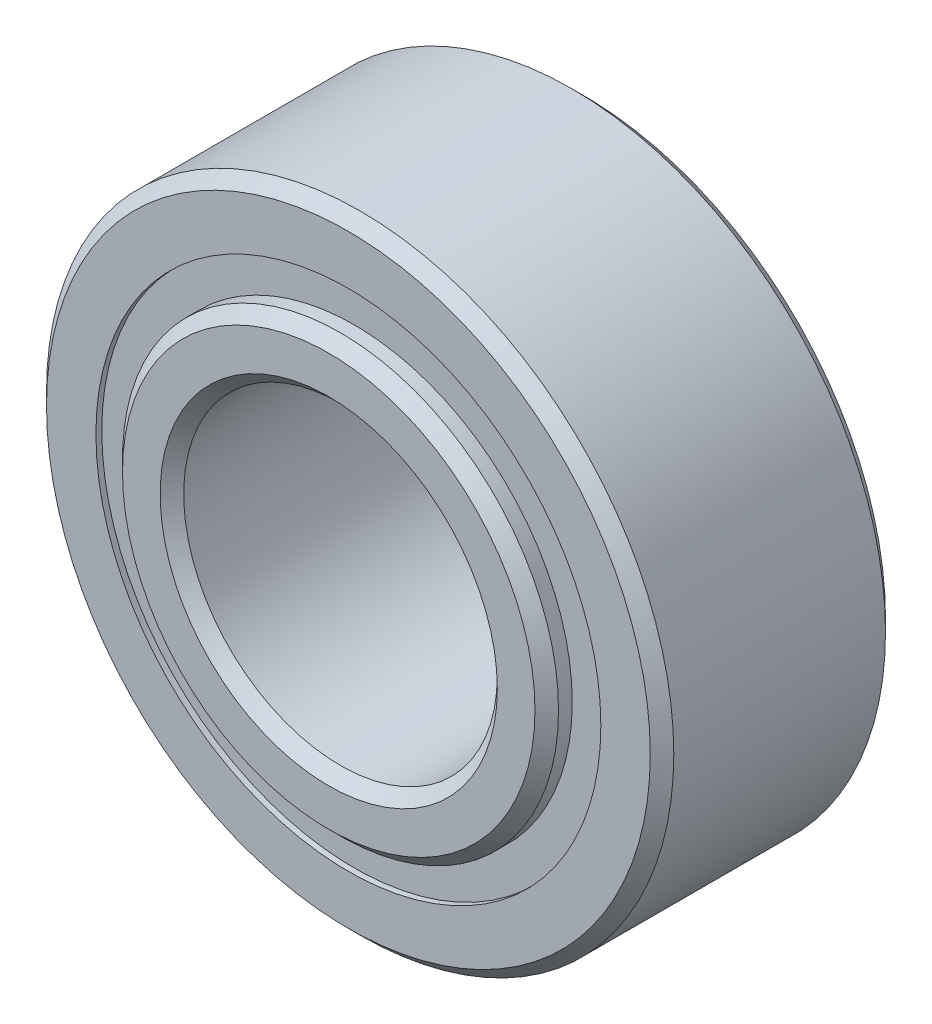
ISO-10303-21;
HEADER;
FILE_DESCRIPTION(('STEP AP214'),'2;1');
FILE_NAME('part.step','',(''),(''),'','','');
FILE_SCHEMA(('AUTOMOTIVE_DESIGN { 1 0 10303 214 1 1 1 1 }'));
ENDSEC;
DATA;
#1=APPLICATION_CONTEXT('core data for automotive mechanical design processes');
#2=APPLICATION_PROTOCOL_DEFINITION('international standard','automotive_design',2000,#1);
#3=PRODUCT_CONTEXT('',#1,'mechanical');
#4=PRODUCT('Part','Part','',(#3));
#5=PRODUCT_RELATED_PRODUCT_CATEGORY('part','',(#4));
#6=PRODUCT_DEFINITION_FORMATION('','',#4);
#7=PRODUCT_DEFINITION_CONTEXT('part definition',#1,'design');
#8=PRODUCT_DEFINITION('design','',#6,#7);
#9=PRODUCT_DEFINITION_SHAPE('','',#8);
#10=(LENGTH_UNIT() NAMED_UNIT(*) SI_UNIT(.MILLI.,.METRE.));
#11=(NAMED_UNIT(*) PLANE_ANGLE_UNIT() SI_UNIT($,.RADIAN.));
#12=(NAMED_UNIT(*) SI_UNIT($,.STERADIAN.) SOLID_ANGLE_UNIT());
#13=UNCERTAINTY_MEASURE_WITH_UNIT(LENGTH_MEASURE(1.E-05),#10,'distance_accuracy_value','');
#14=(GEOMETRIC_REPRESENTATION_CONTEXT(3) GLOBAL_UNCERTAINTY_ASSIGNED_CONTEXT((#13)) GLOBAL_UNIT_ASSIGNED_CONTEXT((#10,
#11,#12)) REPRESENTATION_CONTEXT('',''));
#15=CARTESIAN_POINT('',(0.,0.,0.));
#16=DIRECTION('',(0.,0.,1.));
#17=DIRECTION('',(1.,0.,0.));
#18=AXIS2_PLACEMENT_3D('',#15,#16,#17);
#19=CARTESIAN_POINT('',(0.,5.1114010989011,-2.2621875));
#20=DIRECTION('',(0.,0.,1.));
#21=DIRECTION('',(1.,0.,0.));
#22=AXIS2_PLACEMENT_3D('',#19,#20,#21);
#23=PLANE('',#22);
#24=CARTESIAN_POINT('',(0.,0.,-2.2621875));
#25=DIRECTION('',(0.,0.,1.));
#26=DIRECTION('',(1.,0.,0.));
#27=AXIS2_PLACEMENT_3D('',#24,#25,#26);
#28=CIRCLE('',#27,5.1114010989011);
#29=CARTESIAN_POINT('',(5.1114010989011,0.,-2.2621875));
#30=VERTEX_POINT('',#29);
#31=EDGE_CURVE('E56',#30,#30,#28,.T.);
#32=ORIENTED_EDGE('',*,*,#31,.F.);
#33=EDGE_LOOP('',(#32));
#34=FACE_BOUND('',#33,.T.);
#35=CARTESIAN_POINT('',(0.,0.,-2.2621875));
#36=DIRECTION('',(0.,0.,1.));
#37=DIRECTION('',(1.,0.,0.));
#38=AXIS2_PLACEMENT_3D('',#35,#36,#37);
#39=CIRCLE('',#38,4.41359890109897);
#40=CARTESIAN_POINT('',(4.41359890109897,0.,-2.2621875));
#41=VERTEX_POINT('',#40);
#42=EDGE_CURVE('E11',#41,#41,#39,.T.);
#43=ORIENTED_EDGE('',*,*,#42,.T.);
#44=EDGE_LOOP('',(#43));
#45=FACE_BOUND('',#44,.T.);
#46=ADVANCED_FACE('F42',(#34,#45),#23,.F.);
#47=CARTESIAN_POINT('',(0.,0.,2.38125));
#48=DIRECTION('',(0.,0.,1.));
#49=DIRECTION('',(1.,0.,0.));
#50=AXIS2_PLACEMENT_3D('',#47,#48,#49);
#51=CYLINDRICAL_SURFACE('',#50,4.41359890109897);
#52=ORIENTED_EDGE('',*,*,#42,.F.);
#53=EDGE_LOOP('',(#52));
#54=FACE_BOUND('',#53,.T.);
#55=CARTESIAN_POINT('',(0.,0.,-1.11436144103197));
#56=DIRECTION('',(0.,0.,1.));
#57=DIRECTION('',(1.,0.,0.));
#58=AXIS2_PLACEMENT_3D('',#55,#56,#57);
#59=CIRCLE('',#58,4.41359890109897);
#60=CARTESIAN_POINT('',(4.41359890109897,0.,-1.11436144103197));
#61=VERTEX_POINT('',#60);
#62=EDGE_CURVE('E48',#61,#61,#59,.T.);
#63=ORIENTED_EDGE('',*,*,#62,.T.);
#64=EDGE_LOOP('',(#63));
#65=FACE_BOUND('',#64,.T.);
#66=ADVANCED_FACE('F65',(#54,#65),#51,.F.);
#67=CARTESIAN_POINT('',(0.,5.1114010989011,-1.11436144103197));
#68=DIRECTION('',(0.,0.,-1.));
#69=DIRECTION('',(-1.,0.,0.));
#70=AXIS2_PLACEMENT_3D('',#67,#68,#69);
#71=PLANE('',#70);
#72=ORIENTED_EDGE('',*,*,#62,.F.);
#73=EDGE_LOOP('',(#72));
#74=FACE_BOUND('',#73,.T.);
#75=CARTESIAN_POINT('',(0.,0.,-1.11436144103197));
#76=DIRECTION('',(0.,0.,1.));
#77=DIRECTION('',(1.,0.,0.));
#78=AXIS2_PLACEMENT_3D('',#75,#76,#77);
#79=CIRCLE('',#78,5.1114010989011);
#80=CARTESIAN_POINT('',(5.1114010989011,0.,-1.11436144103197));
#81=VERTEX_POINT('',#80);
#82=EDGE_CURVE('E52',#81,#81,#79,.T.);
#83=ORIENTED_EDGE('',*,*,#82,.T.);
#84=EDGE_LOOP('',(#83));
#85=FACE_BOUND('',#84,.T.);
#86=ADVANCED_FACE('F69',(#74,#85),#71,.F.);
#87=CARTESIAN_POINT('',(0.,0.,2.38125));
#88=DIRECTION('',(0.,0.,1.));
#89=DIRECTION('',(1.,0.,0.));
#90=AXIS2_PLACEMENT_3D('',#87,#88,#89);
#91=CYLINDRICAL_SURFACE('',#90,5.1114010989011);
#92=ORIENTED_EDGE('',*,*,#82,.F.);
#93=EDGE_LOOP('',(#92));
#94=FACE_BOUND('',#93,.T.);
#95=ORIENTED_EDGE('',*,*,#31,.T.);
#96=EDGE_LOOP('',(#95));
#97=FACE_BOUND('',#96,.T.);
#98=ADVANCED_FACE('F62',(#94,#97),#91,.T.);
#99=CLOSED_SHELL('',(#46,#66,#86,#98));
#100=MANIFOLD_SOLID_BREP('B2',#99);
#101=CARTESIAN_POINT('',(0.,5.1114010989011,2.2621875));
#102=DIRECTION('',(0.,0.,-1.));
#103=DIRECTION('',(-1.,0.,0.));
#104=AXIS2_PLACEMENT_3D('',#101,#102,#103);
#105=PLANE('',#104);
#106=CARTESIAN_POINT('',(0.,0.,2.2621875));
#107=DIRECTION('',(0.,0.,1.));
#108=DIRECTION('',(1.,0.,0.));
#109=AXIS2_PLACEMENT_3D('',#106,#107,#108);
#110=CIRCLE('',#109,4.41359890109897);
#111=CARTESIAN_POINT('',(4.41359890109897,0.,2.2621875));
#112=VERTEX_POINT('',#111);
#113=EDGE_CURVE('E41',#112,#112,#110,.T.);
#114=ORIENTED_EDGE('',*,*,#113,.F.);
#115=EDGE_LOOP('',(#114));
#116=FACE_BOUND('',#115,.T.);
#117=CARTESIAN_POINT('',(0.,0.,2.2621875));
#118=DIRECTION('',(0.,0.,1.));
#119=DIRECTION('',(1.,0.,0.));
#120=AXIS2_PLACEMENT_3D('',#117,#118,#119);
#121=CIRCLE('',#120,5.1114010989011);
#122=CARTESIAN_POINT('',(5.1114010989011,0.,2.2621875));
#123=VERTEX_POINT('',#122);
#124=EDGE_CURVE('E124',#123,#123,#121,.T.);
#125=ORIENTED_EDGE('',*,*,#124,.T.);
#126=EDGE_LOOP('',(#125));
#127=FACE_BOUND('',#126,.T.);
#128=ADVANCED_FACE('F110',(#116,#127),#105,.F.);
#129=CARTESIAN_POINT('',(0.,0.,2.38125));
#130=DIRECTION('',(0.,0.,1.));
#131=DIRECTION('',(1.,0.,0.));
#132=AXIS2_PLACEMENT_3D('',#129,#130,#131);
#133=CYLINDRICAL_SURFACE('',#132,4.41359890109897);
#134=CARTESIAN_POINT('',(0.,0.,1.11436144103197));
#135=DIRECTION('',(0.,0.,1.));
#136=DIRECTION('',(1.,0.,0.));
#137=AXIS2_PLACEMENT_3D('',#134,#135,#136);
#138=CIRCLE('',#137,4.41359890109897);
#139=CARTESIAN_POINT('',(4.41359890109897,0.,1.11436144103197));
#140=VERTEX_POINT('',#139);
#141=EDGE_CURVE('E116',#140,#140,#138,.T.);
#142=ORIENTED_EDGE('',*,*,#141,.F.);
#143=EDGE_LOOP('',(#142));
#144=FACE_BOUND('',#143,.T.);
#145=ORIENTED_EDGE('',*,*,#113,.T.);
#146=EDGE_LOOP('',(#145));
#147=FACE_BOUND('',#146,.T.);
#148=ADVANCED_FACE('F139',(#144,#147),#133,.F.);
#149=CARTESIAN_POINT('',(0.,5.1114010989011,1.11436144103197));
#150=DIRECTION('',(0.,0.,1.));
#151=DIRECTION('',(1.,0.,0.));
#152=AXIS2_PLACEMENT_3D('',#149,#150,#151);
#153=PLANE('',#152);
#154=CARTESIAN_POINT('',(0.,0.,1.11436144103197));
#155=DIRECTION('',(0.,0.,1.));
#156=DIRECTION('',(1.,0.,0.));
#157=AXIS2_PLACEMENT_3D('',#154,#155,#156);
#158=CIRCLE('',#157,5.1114010989011);
#159=CARTESIAN_POINT('',(5.1114010989011,0.,1.11436144103197));
#160=VERTEX_POINT('',#159);
#161=EDGE_CURVE('E120',#160,#160,#158,.T.);
#162=ORIENTED_EDGE('',*,*,#161,.F.);
#163=EDGE_LOOP('',(#162));
#164=FACE_BOUND('',#163,.T.);
#165=ORIENTED_EDGE('',*,*,#141,.T.);
#166=EDGE_LOOP('',(#165));
#167=FACE_BOUND('',#166,.T.);
#168=ADVANCED_FACE('F134',(#164,#167),#153,.F.);
#169=CARTESIAN_POINT('',(0.,0.,2.38125));
#170=DIRECTION('',(0.,0.,1.));
#171=DIRECTION('',(1.,0.,0.));
#172=AXIS2_PLACEMENT_3D('',#169,#170,#171);
#173=CYLINDRICAL_SURFACE('',#172,5.1114010989011);
#174=ORIENTED_EDGE('',*,*,#124,.F.);
#175=EDGE_LOOP('',(#174));
#176=FACE_BOUND('',#175,.T.);
#177=ORIENTED_EDGE('',*,*,#161,.T.);
#178=EDGE_LOOP('',(#177));
#179=FACE_BOUND('',#178,.T.);
#180=ADVANCED_FACE('F131',(#176,#179),#173,.T.);
#181=CLOSED_SHELL('',(#128,#148,#168,#180));
#182=MANIFOLD_SOLID_BREP('B6',#181);
#183=CARTESIAN_POINT('',(-2.79932726404285,3.85294343571072,0.));
#184=DIRECTION('',(0.,0.,1.));
#185=DIRECTION('',(-0.587785252292462,0.809016994374955,0.));
#186=AXIS2_PLACEMENT_3D('',#183,#184,#185);
#187=SPHERICAL_SURFACE('',#186,1.11436144103197);
#188=CARTESIAN_POINT('',(-2.79932726404285,3.85294343571072,1.11436144103197));
#189=VERTEX_POINT('',#188);
#190=VERTEX_LOOP('',#189);
#191=FACE_BOUND('',#190,.T.);
#192=ADVANCED_FACE('F177',(#191),#187,.T.);
#193=CLOSED_SHELL('',(#192));
#194=MANIFOLD_SOLID_BREP('B36',#193);
#195=CARTESIAN_POINT('',(-4.52940665885565,1.47169343571074,0.));
#196=DIRECTION('',(0.,0.,1.));
#197=DIRECTION('',(-0.95105651629515,0.309016994374958,0.));
#198=AXIS2_PLACEMENT_3D('',#195,#196,#197);
#199=SPHERICAL_SURFACE('',#198,1.11436144103197);
#200=CARTESIAN_POINT('',(-4.52940665885565,1.47169343571074,1.11436144103197));
#201=VERTEX_POINT('',#200);
#202=VERTEX_LOOP('',#201);
#203=FACE_BOUND('',#202,.T.);
#204=ADVANCED_FACE('F197',(#203),#199,.T.);
#205=CLOSED_SHELL('',(#204));
#206=MANIFOLD_SOLID_BREP('B106',#205);
#207=CARTESIAN_POINT('',(-4.52940665885568,-1.47169343571064,0.));
#208=DIRECTION('',(0.,0.,1.));
#209=DIRECTION('',(-0.951056516295157,-0.309016994374938,0.));
#210=AXIS2_PLACEMENT_3D('',#207,#208,#209);
#211=SPHERICAL_SURFACE('',#210,1.11436144103197);
#212=CARTESIAN_POINT('',(-4.52940665885568,-1.47169343571064,1.11436144103197));
#213=VERTEX_POINT('',#212);
#214=VERTEX_LOOP('',#213);
#215=FACE_BOUND('',#214,.T.);
#216=ADVANCED_FACE('F217',(#215),#211,.T.);
#217=CLOSED_SHELL('',(#216));
#218=MANIFOLD_SOLID_BREP('B173',#217);
#219=CARTESIAN_POINT('',(-2.79932726404294,-3.85294343571066,0.));
#220=DIRECTION('',(0.,0.,1.));
#221=DIRECTION('',(-0.58778525229248,-0.809016994374942,0.));
#222=AXIS2_PLACEMENT_3D('',#219,#220,#221);
#223=SPHERICAL_SURFACE('',#222,1.11436144103197);
#224=CARTESIAN_POINT('',(-2.79932726404294,-3.85294343571066,1.11436144103197));
#225=VERTEX_POINT('',#224);
#226=VERTEX_LOOP('',#225);
#227=FACE_BOUND('',#226,.T.);
#228=ADVANCED_FACE('F237',(#227),#223,.T.);
#229=CLOSED_SHELL('',(#228));
#230=MANIFOLD_SOLID_BREP('B193',#229);
#231=CARTESIAN_POINT('',(0.,-4.7625,0.));
#232=DIRECTION('',(0.,0.,1.));
#233=DIRECTION('',(0.,-1.,0.));
#234=AXIS2_PLACEMENT_3D('',#231,#232,#233);
#235=SPHERICAL_SURFACE('',#234,1.11436144103197);
#236=CARTESIAN_POINT('',(0.,-4.7625,1.11436144103197));
#237=VERTEX_POINT('',#236);
#238=VERTEX_LOOP('',#237);
#239=FACE_BOUND('',#238,.T.);
#240=ADVANCED_FACE('F257',(#239),#235,.T.);
#241=CLOSED_SHELL('',(#240));
#242=MANIFOLD_SOLID_BREP('B213',#241);
#243=CARTESIAN_POINT('',(2.79932726404288,-3.8529434357107,0.));
#244=DIRECTION('',(0.,0.,1.));
#245=DIRECTION('',(0.587785252292469,-0.809016994374951,0.));
#246=AXIS2_PLACEMENT_3D('',#243,#244,#245);
#247=SPHERICAL_SURFACE('',#246,1.11436144103197);
#248=CARTESIAN_POINT('',(2.79932726404288,-3.8529434357107,1.11436144103197));
#249=VERTEX_POINT('',#248);
#250=VERTEX_LOOP('',#249);
#251=FACE_BOUND('',#250,.T.);
#252=ADVANCED_FACE('F277',(#251),#247,.T.);
#253=CLOSED_SHELL('',(#252));
#254=MANIFOLD_SOLID_BREP('B233',#253);
#255=CARTESIAN_POINT('',(4.52940665885566,-1.47169343571071,0.));
#256=DIRECTION('',(0.,0.,1.));
#257=DIRECTION('',(0.951056516295152,-0.309016994374952,0.));
#258=AXIS2_PLACEMENT_3D('',#255,#256,#257);
#259=SPHERICAL_SURFACE('',#258,1.11436144103197);
#260=CARTESIAN_POINT('',(4.52940665885566,-1.47169343571071,1.11436144103197));
#261=VERTEX_POINT('',#260);
#262=VERTEX_LOOP('',#261);
#263=FACE_BOUND('',#262,.T.);
#264=ADVANCED_FACE('F297',(#263),#259,.T.);
#265=CLOSED_SHELL('',(#264));
#266=MANIFOLD_SOLID_BREP('B253',#265);
#267=CARTESIAN_POINT('',(4.52940665885567,1.47169343571067,0.));
#268=DIRECTION('',(0.,0.,1.));
#269=DIRECTION('',(0.951056516295155,0.309016994374945,0.));
#270=AXIS2_PLACEMENT_3D('',#267,#268,#269);
#271=SPHERICAL_SURFACE('',#270,1.11436144103197);
#272=CARTESIAN_POINT('',(4.52940665885567,1.47169343571067,1.11436144103197));
#273=VERTEX_POINT('',#272);
#274=VERTEX_LOOP('',#273);
#275=FACE_BOUND('',#274,.T.);
#276=ADVANCED_FACE('F317',(#275),#271,.T.);
#277=CLOSED_SHELL('',(#276));
#278=MANIFOLD_SOLID_BREP('B273',#277);
#279=CARTESIAN_POINT('',(2.79932726404291,3.85294343571068,0.));
#280=DIRECTION('',(0.,0.,1.));
#281=DIRECTION('',(0.587785252292474,0.809016994374947,0.));
#282=AXIS2_PLACEMENT_3D('',#279,#280,#281);
#283=SPHERICAL_SURFACE('',#282,1.11436144103197);
#284=CARTESIAN_POINT('',(2.79932726404291,3.85294343571068,1.11436144103197));
#285=VERTEX_POINT('',#284);
#286=VERTEX_LOOP('',#285);
#287=FACE_BOUND('',#286,.T.);
#288=ADVANCED_FACE('F337',(#287),#283,.T.);
#289=CLOSED_SHELL('',(#288));
#290=MANIFOLD_SOLID_BREP('B293',#289);
#291=CARTESIAN_POINT('',(0.,4.7625,0.));
#292=DIRECTION('',(0.,0.,1.));
#293=DIRECTION('',(0.,1.,0.));
#294=AXIS2_PLACEMENT_3D('',#291,#292,#293);
#295=SPHERICAL_SURFACE('',#294,1.11436144103197);
#296=CARTESIAN_POINT('',(0.,4.7625,1.11436144103197));
#297=VERTEX_POINT('',#296);
#298=VERTEX_LOOP('',#297);
#299=FACE_BOUND('',#298,.T.);
#300=ADVANCED_FACE('F360',(#299),#295,.T.);
#301=CLOSED_SHELL('',(#300));
#302=MANIFOLD_SOLID_BREP('B313',#301);
#303=CARTESIAN_POINT('',(0.,0.,2.540635));
#304=DIRECTION('',(0.,0.,-1.));
#305=DIRECTION('',(-1.,0.,0.));
#306=AXIS2_PLACEMENT_3D('',#303,#304,#305);
#307=CONICAL_SURFACE('',#306,4.41359890109897,0.785398163397447);
#308=CARTESIAN_POINT('',(0.,0.,2.77876));
#309=DIRECTION('',(0.,0.,1.));
#310=DIRECTION('',(1.,0.,0.));
#311=AXIS2_PLACEMENT_3D('',#308,#309,#310);
#312=CIRCLE('',#311,4.17547390109897);
#313=CARTESIAN_POINT('',(4.17547390109897,0.,2.77876));
#314=VERTEX_POINT('',#313);
#315=EDGE_CURVE('E414',#314,#314,#312,.T.);
#316=ORIENTED_EDGE('',*,*,#315,.F.);
#317=EDGE_LOOP('',(#316));
#318=FACE_BOUND('',#317,.T.);
#319=CARTESIAN_POINT('',(0.,0.,2.540635));
#320=DIRECTION('',(0.,0.,1.));
#321=DIRECTION('',(1.,0.,0.));
#322=AXIS2_PLACEMENT_3D('',#319,#320,#321);
#323=CIRCLE('',#322,4.41359890109897);
#324=CARTESIAN_POINT('',(4.41359890109897,0.,2.540635));
#325=VERTEX_POINT('',#324);
#326=EDGE_CURVE('E359',#325,#325,#323,.T.);
#327=ORIENTED_EDGE('',*,*,#326,.T.);
#328=EDGE_LOOP('',(#327));
#329=FACE_BOUND('',#328,.T.);
#330=ADVANCED_FACE('F380',(#318,#329),#307,.T.);
#331=CARTESIAN_POINT('',(0.,0.,2.38125));
#332=DIRECTION('',(0.,0.,1.));
#333=DIRECTION('',(1.,0.,0.));
#334=AXIS2_PLACEMENT_3D('',#331,#332,#333);
#335=CYLINDRICAL_SURFACE('',#334,4.41359890109897);
#336=ORIENTED_EDGE('',*,*,#326,.F.);
#337=EDGE_LOOP('',(#336));
#338=FACE_BOUND('',#337,.T.);
#339=CARTESIAN_POINT('',(0.,0.,1.05833333333333));
#340=DIRECTION('',(0.,0.,1.));
#341=DIRECTION('',(1.,0.,0.));
#342=AXIS2_PLACEMENT_3D('',#339,#340,#341);
#343=CIRCLE('',#342,4.41359890109897);
#344=CARTESIAN_POINT('',(4.41359890109897,0.,1.05833333333333));
#345=VERTEX_POINT('',#344);
#346=EDGE_CURVE('E386',#345,#345,#343,.T.);
#347=ORIENTED_EDGE('',*,*,#346,.T.);
#348=EDGE_LOOP('',(#347));
#349=FACE_BOUND('',#348,.T.);
#350=ADVANCED_FACE('F421',(#338,#349),#335,.T.);
#351=CARTESIAN_POINT('',(0.,0.,0.));
#352=DIRECTION('',(0.,0.,1.));
#353=DIRECTION('',(1.,0.,0.));
#354=AXIS2_PLACEMENT_3D('',#351,#352,#353);
#355=TOROIDAL_SURFACE('',#354,4.76250000000006,1.11436144103196);
#356=ORIENTED_EDGE('',*,*,#346,.F.);
#357=EDGE_LOOP('',(#356));
#358=FACE_BOUND('',#357,.T.);
#359=CARTESIAN_POINT('',(0.,0.,-1.05833333333333));
#360=DIRECTION('',(0.,0.,1.));
#361=DIRECTION('',(1.,0.,0.));
#362=AXIS2_PLACEMENT_3D('',#359,#360,#361);
#363=CIRCLE('',#362,4.41359890109897);
#364=CARTESIAN_POINT('',(4.41359890109897,0.,-1.05833333333333));
#365=VERTEX_POINT('',#364);
#366=EDGE_CURVE('E390',#365,#365,#363,.T.);
#367=ORIENTED_EDGE('',*,*,#366,.T.);
#368=EDGE_LOOP('',(#367));
#369=FACE_BOUND('',#368,.T.);
#370=ADVANCED_FACE('F425',(#358,#369),#355,.F.);
#371=CARTESIAN_POINT('',(0.,0.,2.38125));
#372=DIRECTION('',(0.,0.,1.));
#373=DIRECTION('',(1.,0.,0.));
#374=AXIS2_PLACEMENT_3D('',#371,#372,#373);
#375=CYLINDRICAL_SURFACE('',#374,4.41359890109897);
#376=ORIENTED_EDGE('',*,*,#366,.F.);
#377=EDGE_LOOP('',(#376));
#378=FACE_BOUND('',#377,.T.);
#379=CARTESIAN_POINT('',(0.,0.,-2.540635));
#380=DIRECTION('',(0.,0.,1.));
#381=DIRECTION('',(1.,0.,0.));
#382=AXIS2_PLACEMENT_3D('',#379,#380,#381);
#383=CIRCLE('',#382,4.41359890109897);
#384=CARTESIAN_POINT('',(4.41359890109897,0.,-2.540635));
#385=VERTEX_POINT('',#384);
#386=EDGE_CURVE('E394',#385,#385,#383,.T.);
#387=ORIENTED_EDGE('',*,*,#386,.T.);
#388=EDGE_LOOP('',(#387));
#389=FACE_BOUND('',#388,.T.);
#390=ADVANCED_FACE('F430',(#378,#389),#375,.T.);
#391=CARTESIAN_POINT('',(0.,0.,-2.77876));
#392=DIRECTION('',(0.,0.,1.));
#393=DIRECTION('',(1.,0.,0.));
#394=AXIS2_PLACEMENT_3D('',#391,#392,#393);
#395=CONICAL_SURFACE('',#394,4.17547390109897,0.785398163397447);
#396=ORIENTED_EDGE('',*,*,#386,.F.);
#397=EDGE_LOOP('',(#396));
#398=FACE_BOUND('',#397,.T.);
#399=CARTESIAN_POINT('',(0.,0.,-2.77876));
#400=DIRECTION('',(0.,0.,1.));
#401=DIRECTION('',(1.,0.,0.));
#402=AXIS2_PLACEMENT_3D('',#399,#400,#401);
#403=CIRCLE('',#402,4.17547390109897);
#404=CARTESIAN_POINT('',(4.17547390109897,0.,-2.77876));
#405=VERTEX_POINT('',#404);
#406=EDGE_CURVE('E399',#405,#405,#403,.T.);
#407=ORIENTED_EDGE('',*,*,#406,.T.);
#408=EDGE_LOOP('',(#407));
#409=FACE_BOUND('',#408,.T.);
#410=ADVANCED_FACE('F436',(#398,#409),#395,.T.);
#411=CARTESIAN_POINT('',(0.,4.17547390109897,-2.77876));
#412=DIRECTION('',(0.,0.,1.));
#413=DIRECTION('',(1.,0.,0.));
#414=AXIS2_PLACEMENT_3D('',#411,#412,#413);
#415=PLANE('',#414);
#416=ORIENTED_EDGE('',*,*,#406,.F.);
#417=EDGE_LOOP('',(#416));
#418=FACE_BOUND('',#417,.T.);
#419=CARTESIAN_POINT('',(0.,0.,-2.77876));
#420=DIRECTION('',(0.,0.,1.));
#421=DIRECTION('',(1.,0.,0.));
#422=AXIS2_PLACEMENT_3D('',#419,#420,#421);
#423=CIRCLE('',#422,3.41312500000007);
#424=CARTESIAN_POINT('',(3.41312500000007,0.,-2.77876));
#425=VERTEX_POINT('',#424);
#426=EDGE_CURVE('E402',#425,#425,#423,.T.);
#427=ORIENTED_EDGE('',*,*,#426,.T.);
#428=EDGE_LOOP('',(#427));
#429=FACE_BOUND('',#428,.T.);
#430=ADVANCED_FACE('F440',(#418,#429),#415,.F.);
#431=CARTESIAN_POINT('',(0.,0.,-2.540635));
#432=DIRECTION('',(0.,0.,-1.));
#433=DIRECTION('',(-1.,0.,0.));
#434=AXIS2_PLACEMENT_3D('',#431,#432,#433);
#435=CONICAL_SURFACE('',#434,3.17500000000007,0.785398163397447);
#436=ORIENTED_EDGE('',*,*,#426,.F.);
#437=EDGE_LOOP('',(#436));
#438=FACE_BOUND('',#437,.T.);
#439=CARTESIAN_POINT('',(0.,0.,-2.540635));
#440=DIRECTION('',(0.,0.,1.));
#441=DIRECTION('',(1.,0.,0.));
#442=AXIS2_PLACEMENT_3D('',#439,#440,#441);
#443=CIRCLE('',#442,3.17500000000007);
#444=CARTESIAN_POINT('',(3.17500000000007,0.,-2.540635));
#445=VERTEX_POINT('',#444);
#446=EDGE_CURVE('E405',#445,#445,#443,.T.);
#447=ORIENTED_EDGE('',*,*,#446,.T.);
#448=EDGE_LOOP('',(#447));
#449=FACE_BOUND('',#448,.T.);
#450=ADVANCED_FACE('F444',(#438,#449),#435,.F.);
#451=CARTESIAN_POINT('',(0.,0.,2.38125));
#452=DIRECTION('',(0.,0.,1.));
#453=DIRECTION('',(1.,0.,0.));
#454=AXIS2_PLACEMENT_3D('',#451,#452,#453);
#455=CYLINDRICAL_SURFACE('',#454,3.17500000000007);
#456=ORIENTED_EDGE('',*,*,#446,.F.);
#457=EDGE_LOOP('',(#456));
#458=FACE_BOUND('',#457,.T.);
#459=CARTESIAN_POINT('',(0.,0.,2.540635));
#460=DIRECTION('',(0.,0.,1.));
#461=DIRECTION('',(1.,0.,0.));
#462=AXIS2_PLACEMENT_3D('',#459,#460,#461);
#463=CIRCLE('',#462,3.17500000000007);
#464=CARTESIAN_POINT('',(3.17500000000007,0.,2.540635));
#465=VERTEX_POINT('',#464);
#466=EDGE_CURVE('E408',#465,#465,#463,.T.);
#467=ORIENTED_EDGE('',*,*,#466,.T.);
#468=EDGE_LOOP('',(#467));
#469=FACE_BOUND('',#468,.T.);
#470=ADVANCED_FACE('F448',(#458,#469),#455,.F.);
#471=CARTESIAN_POINT('',(0.,0.,2.77876));
#472=DIRECTION('',(0.,0.,1.));
#473=DIRECTION('',(1.,0.,0.));
#474=AXIS2_PLACEMENT_3D('',#471,#472,#473);
#475=CONICAL_SURFACE('',#474,3.41312500000007,0.78539816339745);
#476=ORIENTED_EDGE('',*,*,#466,.F.);
#477=EDGE_LOOP('',(#476));
#478=FACE_BOUND('',#477,.T.);
#479=CARTESIAN_POINT('',(0.,0.,2.77876));
#480=DIRECTION('',(0.,0.,1.));
#481=DIRECTION('',(1.,0.,0.));
#482=AXIS2_PLACEMENT_3D('',#479,#480,#481);
#483=CIRCLE('',#482,3.41312500000007);
#484=CARTESIAN_POINT('',(3.41312500000007,0.,2.77876));
#485=VERTEX_POINT('',#484);
#486=EDGE_CURVE('E411',#485,#485,#483,.T.);
#487=ORIENTED_EDGE('',*,*,#486,.T.);
#488=EDGE_LOOP('',(#487));
#489=FACE_BOUND('',#488,.T.);
#490=ADVANCED_FACE('F452',(#478,#489),#475,.F.);
#491=CARTESIAN_POINT('',(0.,3.41312500000007,2.77876));
#492=DIRECTION('',(0.,0.,-1.));
#493=DIRECTION('',(-1.,0.,0.));
#494=AXIS2_PLACEMENT_3D('',#491,#492,#493);
#495=PLANE('',#494);
#496=ORIENTED_EDGE('',*,*,#486,.F.);
#497=EDGE_LOOP('',(#496));
#498=FACE_BOUND('',#497,.T.);
#499=ORIENTED_EDGE('',*,*,#315,.T.);
#500=EDGE_LOOP('',(#499));
#501=FACE_BOUND('',#500,.T.);
#502=ADVANCED_FACE('F418',(#498,#501),#495,.F.);
#503=CLOSED_SHELL('',(#330,#350,#370,#390,#410,#430,#450,#470,#490,#502));
#504=MANIFOLD_SOLID_BREP('B333',#503);
#505=CARTESIAN_POINT('',(0.,0.,2.143125));
#506=DIRECTION('',(0.,0.,-1.));
#507=DIRECTION('',(-1.,0.,0.));
#508=AXIS2_PLACEMENT_3D('',#505,#506,#507);
#509=CONICAL_SURFACE('',#508,6.35,0.785398163397447);
#510=CARTESIAN_POINT('',(0.,0.,2.38125));
#511=DIRECTION('',(0.,0.,1.));
#512=DIRECTION('',(1.,0.,0.));
#513=AXIS2_PLACEMENT_3D('',#510,#511,#512);
#514=CIRCLE('',#513,6.111875);
#515=CARTESIAN_POINT('',(6.111875,0.,2.38125));
#516=VERTEX_POINT('',#515);
#517=EDGE_CURVE('E560',#516,#516,#514,.T.);
#518=ORIENTED_EDGE('',*,*,#517,.F.);
#519=EDGE_LOOP('',(#518));
#520=FACE_BOUND('',#519,.T.);
#521=CARTESIAN_POINT('',(0.,0.,2.143125));
#522=DIRECTION('',(0.,0.,1.));
#523=DIRECTION('',(1.,0.,0.));
#524=AXIS2_PLACEMENT_3D('',#521,#522,#523);
#525=CIRCLE('',#524,6.35);
#526=CARTESIAN_POINT('',(6.35,0.,2.143125));
#527=VERTEX_POINT('',#526);
#528=EDGE_CURVE('E379',#527,#527,#525,.T.);
#529=ORIENTED_EDGE('',*,*,#528,.T.);
#530=EDGE_LOOP('',(#529));
#531=FACE_BOUND('',#530,.T.);
#532=ADVANCED_FACE('F532',(#520,#531),#509,.T.);
#533=CARTESIAN_POINT('',(0.,0.,2.38125));
#534=DIRECTION('',(0.,0.,1.));
#535=DIRECTION('',(1.,0.,0.));
#536=AXIS2_PLACEMENT_3D('',#533,#534,#535);
#537=CYLINDRICAL_SURFACE('',#536,6.35);
#538=ORIENTED_EDGE('',*,*,#528,.F.);
#539=EDGE_LOOP('',(#538));
#540=FACE_BOUND('',#539,.T.);
#541=CARTESIAN_POINT('',(0.,0.,-2.143125));
#542=DIRECTION('',(0.,0.,1.));
#543=DIRECTION('',(1.,0.,0.));
#544=AXIS2_PLACEMENT_3D('',#541,#542,#543);
#545=CIRCLE('',#544,6.35);
#546=CARTESIAN_POINT('',(6.35,0.,-2.143125));
#547=VERTEX_POINT('',#546);
#548=EDGE_CURVE('E538',#547,#547,#545,.T.);
#549=ORIENTED_EDGE('',*,*,#548,.T.);
#550=EDGE_LOOP('',(#549));
#551=FACE_BOUND('',#550,.T.);
#552=ADVANCED_FACE('F567',(#540,#551),#537,.T.);
#553=CARTESIAN_POINT('',(0.,0.,-2.38125));
#554=DIRECTION('',(0.,0.,1.));
#555=DIRECTION('',(1.,0.,0.));
#556=AXIS2_PLACEMENT_3D('',#553,#554,#555);
#557=CONICAL_SURFACE('',#556,6.111875,0.785398163397445);
#558=ORIENTED_EDGE('',*,*,#548,.F.);
#559=EDGE_LOOP('',(#558));
#560=FACE_BOUND('',#559,.T.);
#561=CARTESIAN_POINT('',(0.,0.,-2.38125));
#562=DIRECTION('',(0.,0.,1.));
#563=DIRECTION('',(1.,0.,0.));
#564=AXIS2_PLACEMENT_3D('',#561,#562,#563);
#565=CIRCLE('',#564,6.111875);
#566=CARTESIAN_POINT('',(6.111875,0.,-2.38125));
#567=VERTEX_POINT('',#566);
#568=EDGE_CURVE('E542',#567,#567,#565,.T.);
#569=ORIENTED_EDGE('',*,*,#568,.T.);
#570=EDGE_LOOP('',(#569));
#571=FACE_BOUND('',#570,.T.);
#572=ADVANCED_FACE('F571',(#560,#571),#557,.T.);
#573=CARTESIAN_POINT('',(0.,6.111875,-2.38125));
#574=DIRECTION('',(0.,0.,1.));
#575=DIRECTION('',(1.,0.,0.));
#576=AXIS2_PLACEMENT_3D('',#573,#574,#575);
#577=PLANE('',#576);
#578=ORIENTED_EDGE('',*,*,#568,.F.);
#579=EDGE_LOOP('',(#578));
#580=FACE_BOUND('',#579,.T.);
#581=CARTESIAN_POINT('',(0.,0.,-2.38125));
#582=DIRECTION('',(0.,0.,1.));
#583=DIRECTION('',(1.,0.,0.));
#584=AXIS2_PLACEMENT_3D('',#581,#582,#583);
#585=CIRCLE('',#584,5.1114010989011);
#586=CARTESIAN_POINT('',(5.1114010989011,0.,-2.38125));
#587=VERTEX_POINT('',#586);
#588=EDGE_CURVE('E546',#587,#587,#585,.T.);
#589=ORIENTED_EDGE('',*,*,#588,.T.);
#590=EDGE_LOOP('',(#589));
#591=FACE_BOUND('',#590,.T.);
#592=ADVANCED_FACE('F576',(#580,#591),#577,.F.);
#593=CARTESIAN_POINT('',(0.,0.,2.38125));
#594=DIRECTION('',(0.,0.,1.));
#595=DIRECTION('',(1.,0.,0.));
#596=AXIS2_PLACEMENT_3D('',#593,#594,#595);
#597=CYLINDRICAL_SURFACE('',#596,5.1114010989011);
#598=ORIENTED_EDGE('',*,*,#588,.F.);
#599=EDGE_LOOP('',(#598));
#600=FACE_BOUND('',#599,.T.);
#601=CARTESIAN_POINT('',(0.,0.,-1.05833333333333));
#602=DIRECTION('',(0.,0.,1.));
#603=DIRECTION('',(1.,0.,0.));
#604=AXIS2_PLACEMENT_3D('',#601,#602,#603);
#605=CIRCLE('',#604,5.1114010989011);
#606=CARTESIAN_POINT('',(5.1114010989011,0.,-1.05833333333333));
#607=VERTEX_POINT('',#606);
#608=EDGE_CURVE('E551',#607,#607,#605,.T.);
#609=ORIENTED_EDGE('',*,*,#608,.T.);
#610=EDGE_LOOP('',(#609));
#611=FACE_BOUND('',#610,.T.);
#612=ADVANCED_FACE('F582',(#600,#611),#597,.F.);
#613=CARTESIAN_POINT('',(0.,0.,0.));
#614=DIRECTION('',(0.,0.,1.));
#615=DIRECTION('',(1.,0.,0.));
#616=AXIS2_PLACEMENT_3D('',#613,#614,#615);
#617=TOROIDAL_SURFACE('',#616,4.7625,1.11436144103197);
#618=ORIENTED_EDGE('',*,*,#608,.F.);
#619=EDGE_LOOP('',(#618));
#620=FACE_BOUND('',#619,.T.);
#621=CARTESIAN_POINT('',(0.,0.,1.05833333333333));
#622=DIRECTION('',(0.,0.,1.));
#623=DIRECTION('',(1.,0.,0.));
#624=AXIS2_PLACEMENT_3D('',#621,#622,#623);
#625=CIRCLE('',#624,5.1114010989011);
#626=CARTESIAN_POINT('',(5.1114010989011,0.,1.05833333333333));
#627=VERTEX_POINT('',#626);
#628=EDGE_CURVE('E554',#627,#627,#625,.T.);
#629=ORIENTED_EDGE('',*,*,#628,.T.);
#630=EDGE_LOOP('',(#629));
#631=FACE_BOUND('',#630,.T.);
#632=ADVANCED_FACE('F586',(#620,#631),#617,.F.);
#633=CARTESIAN_POINT('',(0.,0.,2.38125));
#634=DIRECTION('',(0.,0.,1.));
#635=DIRECTION('',(1.,0.,0.));
#636=AXIS2_PLACEMENT_3D('',#633,#634,#635);
#637=CYLINDRICAL_SURFACE('',#636,5.1114010989011);
#638=ORIENTED_EDGE('',*,*,#628,.F.);
#639=EDGE_LOOP('',(#638));
#640=FACE_BOUND('',#639,.T.);
#641=CARTESIAN_POINT('',(0.,0.,2.38125));
#642=DIRECTION('',(0.,0.,1.));
#643=DIRECTION('',(1.,0.,0.));
#644=AXIS2_PLACEMENT_3D('',#641,#642,#643);
#645=CIRCLE('',#644,5.1114010989011);
#646=CARTESIAN_POINT('',(5.1114010989011,0.,2.38125));
#647=VERTEX_POINT('',#646);
#648=EDGE_CURVE('E557',#647,#647,#645,.T.);
#649=ORIENTED_EDGE('',*,*,#648,.T.);
#650=EDGE_LOOP('',(#649));
#651=FACE_BOUND('',#650,.T.);
#652=ADVANCED_FACE('F590',(#640,#651),#637,.F.);
#653=CARTESIAN_POINT('',(0.,6.111875,2.38125));
#654=DIRECTION('',(0.,0.,-1.));
#655=DIRECTION('',(-1.,0.,0.));
#656=AXIS2_PLACEMENT_3D('',#653,#654,#655);
#657=PLANE('',#656);
#658=ORIENTED_EDGE('',*,*,#648,.F.);
#659=EDGE_LOOP('',(#658));
#660=FACE_BOUND('',#659,.T.);
#661=ORIENTED_EDGE('',*,*,#517,.T.);
#662=EDGE_LOOP('',(#661));
#663=FACE_BOUND('',#662,.T.);
#664=ADVANCED_FACE('F564',(#660,#663),#657,.F.);
#665=CLOSED_SHELL('',(#532,#552,#572,#592,#612,#632,#652,#664));
#666=MANIFOLD_SOLID_BREP('B354',#665);
#667=ADVANCED_BREP_SHAPE_REPRESENTATION('',(#18,#100,#182,#194,#206,#218,#230,#242,#254,#266,
#278,#290,#302,#504,#666),#14);
#668=SHAPE_DEFINITION_REPRESENTATION(#9,#667);
ENDSEC;
END-ISO-10303-21;
